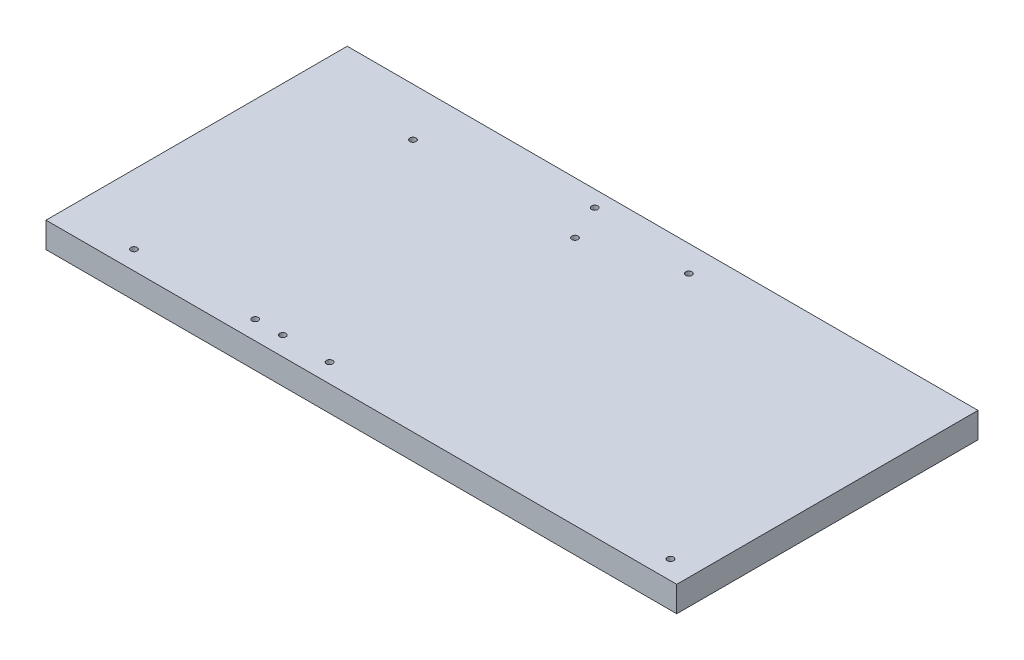
ISO-10303-21;
HEADER;
FILE_DESCRIPTION(('STEP AP214'),'2;1');
FILE_NAME('part.step','',(''),(''),'','','');
FILE_SCHEMA(('AUTOMOTIVE_DESIGN { 1 0 10303 214 1 1 1 1 }'));
ENDSEC;
DATA;
#1=APPLICATION_CONTEXT('core data for automotive mechanical design processes');
#2=APPLICATION_PROTOCOL_DEFINITION('international standard','automotive_design',2000,#1);
#3=PRODUCT_CONTEXT('',#1,'mechanical');
#4=PRODUCT('Part','Part','',(#3));
#5=PRODUCT_RELATED_PRODUCT_CATEGORY('part','',(#4));
#6=PRODUCT_DEFINITION_FORMATION('','',#4);
#7=PRODUCT_DEFINITION_CONTEXT('part definition',#1,'design');
#8=PRODUCT_DEFINITION('design','',#6,#7);
#9=PRODUCT_DEFINITION_SHAPE('','',#8);
#10=(LENGTH_UNIT() NAMED_UNIT(*) SI_UNIT(.MILLI.,.METRE.));
#11=(NAMED_UNIT(*) PLANE_ANGLE_UNIT() SI_UNIT($,.RADIAN.));
#12=(NAMED_UNIT(*) SI_UNIT($,.STERADIAN.) SOLID_ANGLE_UNIT());
#13=UNCERTAINTY_MEASURE_WITH_UNIT(LENGTH_MEASURE(1.E-05),#10,'distance_accuracy_value','');
#14=(GEOMETRIC_REPRESENTATION_CONTEXT(3) GLOBAL_UNCERTAINTY_ASSIGNED_CONTEXT((#13)) GLOBAL_UNIT_ASSIGNED_CONTEXT((#10,
#11,#12)) REPRESENTATION_CONTEXT('',''));
#15=CARTESIAN_POINT('',(0.,0.,0.));
#16=DIRECTION('',(0.,0.,1.));
#17=DIRECTION('',(1.,0.,0.));
#18=AXIS2_PLACEMENT_3D('',#15,#16,#17);
#19=CARTESIAN_POINT('',(-254.781538461539,25.8318,-148.492307692308));
#20=DIRECTION('',(1.,0.,0.));
#21=DIRECTION('',(0.,0.,-1.));
#22=AXIS2_PLACEMENT_3D('',#19,#20,#21);
#23=PLANE('',#22);
#24=DIRECTION('',(0.,0.,1.));
#25=VECTOR('',#24,1.);
#26=CARTESIAN_POINT('',(-254.781538461539,0.,-148.492307692308));
#27=LINE('',#26,#25);
#28=CARTESIAN_POINT('',(-254.781538461539,0.,-148.492307692308));
#29=VERTEX_POINT('',#28);
#30=CARTESIAN_POINT('',(-254.781538461539,0.,156.307692307692));
#31=VERTEX_POINT('',#30);
#32=EDGE_CURVE('E101',#29,#31,#27,.T.);
#33=ORIENTED_EDGE('',*,*,#32,.T.);
#34=DIRECTION('',(0.,-1.,0.));
#35=VECTOR('',#34,1.);
#36=CARTESIAN_POINT('',(-254.781538461539,25.8318,156.307692307692));
#37=LINE('',#36,#35);
#38=CARTESIAN_POINT('',(-254.781538461539,25.8318,156.307692307692));
#39=VERTEX_POINT('',#38);
#40=EDGE_CURVE('E11',#39,#31,#37,.T.);
#41=ORIENTED_EDGE('',*,*,#40,.F.);
#42=DIRECTION('',(0.,0.,1.));
#43=VECTOR('',#42,1.);
#44=CARTESIAN_POINT('',(-254.781538461539,25.8318,-148.492307692308));
#45=LINE('',#44,#43);
#46=CARTESIAN_POINT('',(-254.781538461539,25.8318,-148.492307692308));
#47=VERTEX_POINT('',#46);
#48=EDGE_CURVE('E89',#47,#39,#45,.T.);
#49=ORIENTED_EDGE('',*,*,#48,.F.);
#50=DIRECTION('',(0.,-1.,0.));
#51=VECTOR('',#50,1.);
#52=CARTESIAN_POINT('',(-254.781538461539,25.8318,-148.492307692308));
#53=LINE('',#52,#51);
#54=EDGE_CURVE('E97',#47,#29,#53,.T.);
#55=ORIENTED_EDGE('',*,*,#54,.T.);
#56=EDGE_LOOP('',(#33,#41,#49,#55));
#57=FACE_BOUND('',#56,.T.);
#58=ADVANCED_FACE('F38',(#57),#23,.F.);
#59=CARTESIAN_POINT('',(-254.781538461539,25.8318,156.307692307692));
#60=DIRECTION('',(0.,0.,-1.));
#61=DIRECTION('',(-1.,0.,0.));
#62=AXIS2_PLACEMENT_3D('',#59,#60,#61);
#63=PLANE('',#62);
#64=DIRECTION('',(1.,0.,0.));
#65=VECTOR('',#64,1.);
#66=CARTESIAN_POINT('',(-254.781538461539,0.,156.307692307692));
#67=LINE('',#66,#65);
#68=CARTESIAN_POINT('',(383.393461538461,0.,156.307692307692));
#69=VERTEX_POINT('',#68);
#70=EDGE_CURVE('E93',#31,#69,#67,.T.);
#71=ORIENTED_EDGE('',*,*,#70,.T.);
#72=DIRECTION('',(0.,-1.,0.));
#73=VECTOR('',#72,1.);
#74=CARTESIAN_POINT('',(383.393461538461,25.8318,156.307692307692));
#75=LINE('',#74,#73);
#76=CARTESIAN_POINT('',(383.393461538461,25.8318,156.307692307692));
#77=VERTEX_POINT('',#76);
#78=EDGE_CURVE('E46',#77,#69,#75,.T.);
#79=ORIENTED_EDGE('',*,*,#78,.F.);
#80=DIRECTION('',(1.,0.,0.));
#81=VECTOR('',#80,1.);
#82=CARTESIAN_POINT('',(-254.781538461539,25.8318,156.307692307692));
#83=LINE('',#82,#81);
#84=EDGE_CURVE('E84',#39,#77,#83,.T.);
#85=ORIENTED_EDGE('',*,*,#84,.F.);
#86=ORIENTED_EDGE('',*,*,#40,.T.);
#87=EDGE_LOOP('',(#71,#79,#85,#86));
#88=FACE_BOUND('',#87,.T.);
#89=ADVANCED_FACE('F92',(#88),#63,.F.);
#90=CARTESIAN_POINT('',(383.393461538461,25.8318,-148.492307692308));
#91=DIRECTION('',(-1.,0.,0.));
#92=DIRECTION('',(0.,0.,1.));
#93=AXIS2_PLACEMENT_3D('',#90,#91,#92);
#94=PLANE('',#93);
#95=DIRECTION('',(0.,0.,-1.));
#96=VECTOR('',#95,1.);
#97=CARTESIAN_POINT('',(383.393461538461,0.,-148.492307692308));
#98=LINE('',#97,#96);
#99=CARTESIAN_POINT('',(383.393461538461,0.,-148.492307692308));
#100=VERTEX_POINT('',#99);
#101=EDGE_CURVE('E71',#69,#100,#98,.T.);
#102=ORIENTED_EDGE('',*,*,#101,.T.);
#103=DIRECTION('',(0.,-1.,0.));
#104=VECTOR('',#103,1.);
#105=CARTESIAN_POINT('',(383.393461538461,25.8318,-148.492307692308));
#106=LINE('',#105,#104);
#107=CARTESIAN_POINT('',(383.393461538461,25.8318,-148.492307692308));
#108=VERTEX_POINT('',#107);
#109=EDGE_CURVE('E94',#108,#100,#106,.T.);
#110=ORIENTED_EDGE('',*,*,#109,.F.);
#111=DIRECTION('',(0.,0.,-1.));
#112=VECTOR('',#111,1.);
#113=CARTESIAN_POINT('',(383.393461538461,25.8318,-148.492307692308));
#114=LINE('',#113,#112);
#115=EDGE_CURVE('E87',#77,#108,#114,.T.);
#116=ORIENTED_EDGE('',*,*,#115,.F.);
#117=ORIENTED_EDGE('',*,*,#78,.T.);
#118=EDGE_LOOP('',(#102,#110,#116,#117));
#119=FACE_BOUND('',#118,.T.);
#120=ADVANCED_FACE('F95',(#119),#94,.F.);
#121=CARTESIAN_POINT('',(-254.781538461539,25.8318,-148.492307692308));
#122=DIRECTION('',(0.,0.,1.));
#123=DIRECTION('',(1.,0.,0.));
#124=AXIS2_PLACEMENT_3D('',#121,#122,#123);
#125=PLANE('',#124);
#126=DIRECTION('',(-1.,0.,0.));
#127=VECTOR('',#126,1.);
#128=CARTESIAN_POINT('',(-254.781538461539,0.,-148.492307692308));
#129=LINE('',#128,#127);
#130=EDGE_CURVE('E77',#100,#29,#129,.T.);
#131=ORIENTED_EDGE('',*,*,#130,.T.);
#132=ORIENTED_EDGE('',*,*,#54,.F.);
#133=DIRECTION('',(-1.,0.,0.));
#134=VECTOR('',#133,1.);
#135=CARTESIAN_POINT('',(-254.781538461539,25.8318,-148.492307692308));
#136=LINE('',#135,#134);
#137=EDGE_CURVE('E54',#108,#47,#136,.T.);
#138=ORIENTED_EDGE('',*,*,#137,.F.);
#139=ORIENTED_EDGE('',*,*,#109,.T.);
#140=EDGE_LOOP('',(#131,#132,#138,#139));
#141=FACE_BOUND('',#140,.T.);
#142=ADVANCED_FACE('F109',(#141),#125,.F.);
#143=CARTESIAN_POINT('',(0.,25.8318,0.));
#144=DIRECTION('',(0.,1.,0.));
#145=DIRECTION('',(0.,0.,1.));
#146=AXIS2_PLACEMENT_3D('',#143,#144,#145);
#147=PLANE('',#146);
#148=CARTESIAN_POINT('',(-139.599326464026,25.8318,-99.7621595731455));
#149=DIRECTION('',(0.,1.,0.));
#150=DIRECTION('',(0.,0.,1.));
#151=AXIS2_PLACEMENT_3D('',#148,#149,#150);
#152=CIRCLE('',#151,3.17499999999997);
#153=CARTESIAN_POINT('',(-139.599326464026,25.8318,-96.5871595731456));
#154=VERTEX_POINT('',#153);
#155=EDGE_CURVE('E163',#154,#154,#152,.T.);
#156=ORIENTED_EDGE('',*,*,#155,.F.);
#157=EDGE_LOOP('',(#156));
#158=FACE_BOUND('',#157,.T.);
#159=CARTESIAN_POINT('',(-184.761358461539,25.8318,137.257692307692));
#160=DIRECTION('',(0.,1.,0.));
#161=DIRECTION('',(0.,0.,1.));
#162=AXIS2_PLACEMENT_3D('',#159,#160,#161);
#163=CIRCLE('',#162,3.17499999999997);
#164=CARTESIAN_POINT('',(-184.761358461539,25.8318,140.432692307692));
#165=VERTEX_POINT('',#164);
#166=EDGE_CURVE('E157',#165,#165,#163,.T.);
#167=ORIENTED_EDGE('',*,*,#166,.F.);
#168=EDGE_LOOP('',(#167));
#169=FACE_BOUND('',#168,.T.);
#170=CARTESIAN_POINT('',(28.2792136055013,25.8318,-95.8475990146713));
#171=DIRECTION('',(0.,1.,0.));
#172=DIRECTION('',(0.,0.,1.));
#173=AXIS2_PLACEMENT_3D('',#170,#171,#172);
#174=CIRCLE('',#173,3.17499999999999);
#175=CARTESIAN_POINT('',(28.2792136055013,25.8318,-92.6725990146713));
#176=VERTEX_POINT('',#175);
#177=EDGE_CURVE('E151',#176,#176,#174,.T.);
#178=ORIENTED_EDGE('',*,*,#177,.F.);
#179=EDGE_LOOP('',(#178));
#180=FACE_BOUND('',#179,.T.);
#181=CARTESIAN_POINT('',(-34.2536584615385,25.8318,137.257692307692));
#182=DIRECTION('',(0.,1.,0.));
#183=DIRECTION('',(0.,0.,1.));
#184=AXIS2_PLACEMENT_3D('',#181,#182,#183);
#185=CIRCLE('',#184,3.175);
#186=CARTESIAN_POINT('',(-34.2536584615385,25.8318,140.432692307692));
#187=VERTEX_POINT('',#186);
#188=EDGE_CURVE('E145',#187,#187,#185,.T.);
#189=ORIENTED_EDGE('',*,*,#188,.F.);
#190=EDGE_LOOP('',(#189));
#191=FACE_BOUND('',#190,.T.);
#192=CARTESIAN_POINT('',(117.275186709769,25.8318,-122.058176561719));
#193=DIRECTION('',(0.,1.,0.));
#194=DIRECTION('',(0.,0.,1.));
#195=AXIS2_PLACEMENT_3D('',#192,#193,#194);
#196=CIRCLE('',#195,3.175);
#197=CARTESIAN_POINT('',(117.275186709769,25.8318,-118.883176561719));
#198=VERTEX_POINT('',#197);
#199=EDGE_CURVE('E139',#198,#198,#196,.T.);
#200=ORIENTED_EDGE('',*,*,#199,.F.);
#201=EDGE_LOOP('',(#200));
#202=FACE_BOUND('',#201,.T.);
#203=CARTESIAN_POINT('',(13.1275015384614,25.8318,137.257692307692));
#204=DIRECTION('',(0.,1.,0.));
#205=DIRECTION('',(0.,0.,1.));
#206=AXIS2_PLACEMENT_3D('',#203,#204,#205);
#207=CIRCLE('',#206,3.175);
#208=CARTESIAN_POINT('',(13.1275015384614,25.8318,140.432692307692));
#209=VERTEX_POINT('',#208);
#210=EDGE_CURVE('E133',#209,#209,#207,.T.);
#211=ORIENTED_EDGE('',*,*,#210,.F.);
#212=EDGE_LOOP('',(#211));
#213=FACE_BOUND('',#212,.T.);
#214=CARTESIAN_POINT('',(11.8995090717048,25.8318,-132.169098740326));
#215=DIRECTION('',(0.,1.,0.));
#216=DIRECTION('',(0.,0.,1.));
#217=AXIS2_PLACEMENT_3D('',#214,#215,#216);
#218=CIRCLE('',#217,3.175);
#219=CARTESIAN_POINT('',(11.8995090717048,25.8318,-128.994098740326));
#220=VERTEX_POINT('',#219);
#221=EDGE_CURVE('E127',#220,#220,#218,.T.);
#222=ORIENTED_EDGE('',*,*,#221,.F.);
#223=EDGE_LOOP('',(#222));
#224=FACE_BOUND('',#223,.T.);
#225=CARTESIAN_POINT('',(-62.1733384615385,25.8318,137.257692307692));
#226=DIRECTION('',(0.,1.,0.));
#227=DIRECTION('',(0.,0.,1.));
#228=AXIS2_PLACEMENT_3D('',#225,#226,#227);
#229=CIRCLE('',#228,3.175);
#230=CARTESIAN_POINT('',(-62.1733384615385,25.8318,140.432692307692));
#231=VERTEX_POINT('',#230);
#232=EDGE_CURVE('E121',#231,#231,#229,.T.);
#233=ORIENTED_EDGE('',*,*,#232,.F.);
#234=EDGE_LOOP('',(#233));
#235=FACE_BOUND('',#234,.T.);
#236=CARTESIAN_POINT('',(357.993461538461,25.8318,137.257692307692));
#237=DIRECTION('',(0.,1.,0.));
#238=DIRECTION('',(0.,0.,1.));
#239=AXIS2_PLACEMENT_3D('',#236,#237,#238);
#240=CIRCLE('',#239,3.17499999999997);
#241=CARTESIAN_POINT('',(357.993461538461,25.8318,140.432692307692));
#242=VERTEX_POINT('',#241);
#243=EDGE_CURVE('E115',#242,#242,#240,.T.);
#244=ORIENTED_EDGE('',*,*,#243,.F.);
#245=EDGE_LOOP('',(#244));
#246=FACE_BOUND('',#245,.T.);
#247=ORIENTED_EDGE('',*,*,#48,.T.);
#248=ORIENTED_EDGE('',*,*,#84,.T.);
#249=ORIENTED_EDGE('',*,*,#115,.T.);
#250=ORIENTED_EDGE('',*,*,#137,.T.);
#251=EDGE_LOOP('',(#247,#248,#249,#250));
#252=FACE_BOUND('',#251,.T.);
#253=ADVANCED_FACE('F85',(#158,#169,#180,#191,#202,#213,#224,#235,#246,#252),#147,.T.);
#254=CARTESIAN_POINT('',(0.,0.,0.));
#255=DIRECTION('',(0.,1.,0.));
#256=DIRECTION('',(0.,0.,1.));
#257=AXIS2_PLACEMENT_3D('',#254,#255,#256);
#258=PLANE('',#257);
#259=CARTESIAN_POINT('',(-139.599326464026,0.,-99.7621595731455));
#260=DIRECTION('',(0.,1.,0.));
#261=DIRECTION('',(0.,0.,1.));
#262=AXIS2_PLACEMENT_3D('',#259,#260,#261);
#263=CIRCLE('',#262,3.17499999999997);
#264=CARTESIAN_POINT('',(-139.599326464026,0.,-96.5871595731456));
#265=VERTEX_POINT('',#264);
#266=EDGE_CURVE('E160',#265,#265,#263,.T.);
#267=ORIENTED_EDGE('',*,*,#266,.T.);
#268=EDGE_LOOP('',(#267));
#269=FACE_BOUND('',#268,.T.);
#270=CARTESIAN_POINT('',(-184.761358461539,0.,137.257692307692));
#271=DIRECTION('',(0.,1.,0.));
#272=DIRECTION('',(0.,0.,1.));
#273=AXIS2_PLACEMENT_3D('',#270,#271,#272);
#274=CIRCLE('',#273,3.17499999999997);
#275=CARTESIAN_POINT('',(-184.761358461539,0.,140.432692307692));
#276=VERTEX_POINT('',#275);
#277=EDGE_CURVE('E154',#276,#276,#274,.T.);
#278=ORIENTED_EDGE('',*,*,#277,.T.);
#279=EDGE_LOOP('',(#278));
#280=FACE_BOUND('',#279,.T.);
#281=CARTESIAN_POINT('',(28.2792136055013,0.,-95.8475990146713));
#282=DIRECTION('',(0.,1.,0.));
#283=DIRECTION('',(0.,0.,1.));
#284=AXIS2_PLACEMENT_3D('',#281,#282,#283);
#285=CIRCLE('',#284,3.17499999999999);
#286=CARTESIAN_POINT('',(28.2792136055013,0.,-92.6725990146713));
#287=VERTEX_POINT('',#286);
#288=EDGE_CURVE('E148',#287,#287,#285,.T.);
#289=ORIENTED_EDGE('',*,*,#288,.T.);
#290=EDGE_LOOP('',(#289));
#291=FACE_BOUND('',#290,.T.);
#292=CARTESIAN_POINT('',(-34.2536584615385,0.,137.257692307692));
#293=DIRECTION('',(0.,1.,0.));
#294=DIRECTION('',(0.,0.,1.));
#295=AXIS2_PLACEMENT_3D('',#292,#293,#294);
#296=CIRCLE('',#295,3.175);
#297=CARTESIAN_POINT('',(-34.2536584615385,0.,140.432692307692));
#298=VERTEX_POINT('',#297);
#299=EDGE_CURVE('E142',#298,#298,#296,.T.);
#300=ORIENTED_EDGE('',*,*,#299,.T.);
#301=EDGE_LOOP('',(#300));
#302=FACE_BOUND('',#301,.T.);
#303=CARTESIAN_POINT('',(117.275186709769,0.,-122.058176561719));
#304=DIRECTION('',(0.,1.,0.));
#305=DIRECTION('',(0.,0.,1.));
#306=AXIS2_PLACEMENT_3D('',#303,#304,#305);
#307=CIRCLE('',#306,3.175);
#308=CARTESIAN_POINT('',(117.275186709769,0.,-118.883176561719));
#309=VERTEX_POINT('',#308);
#310=EDGE_CURVE('E136',#309,#309,#307,.T.);
#311=ORIENTED_EDGE('',*,*,#310,.T.);
#312=EDGE_LOOP('',(#311));
#313=FACE_BOUND('',#312,.T.);
#314=CARTESIAN_POINT('',(13.1275015384614,0.,137.257692307692));
#315=DIRECTION('',(0.,1.,0.));
#316=DIRECTION('',(0.,0.,1.));
#317=AXIS2_PLACEMENT_3D('',#314,#315,#316);
#318=CIRCLE('',#317,3.175);
#319=CARTESIAN_POINT('',(13.1275015384614,0.,140.432692307692));
#320=VERTEX_POINT('',#319);
#321=EDGE_CURVE('E130',#320,#320,#318,.T.);
#322=ORIENTED_EDGE('',*,*,#321,.T.);
#323=EDGE_LOOP('',(#322));
#324=FACE_BOUND('',#323,.T.);
#325=CARTESIAN_POINT('',(11.8995090717048,0.,-132.169098740326));
#326=DIRECTION('',(0.,1.,0.));
#327=DIRECTION('',(0.,0.,1.));
#328=AXIS2_PLACEMENT_3D('',#325,#326,#327);
#329=CIRCLE('',#328,3.175);
#330=CARTESIAN_POINT('',(11.8995090717048,0.,-128.994098740326));
#331=VERTEX_POINT('',#330);
#332=EDGE_CURVE('E124',#331,#331,#329,.T.);
#333=ORIENTED_EDGE('',*,*,#332,.T.);
#334=EDGE_LOOP('',(#333));
#335=FACE_BOUND('',#334,.T.);
#336=CARTESIAN_POINT('',(-62.1733384615385,0.,137.257692307692));
#337=DIRECTION('',(0.,1.,0.));
#338=DIRECTION('',(0.,0.,1.));
#339=AXIS2_PLACEMENT_3D('',#336,#337,#338);
#340=CIRCLE('',#339,3.175);
#341=CARTESIAN_POINT('',(-62.1733384615385,0.,140.432692307692));
#342=VERTEX_POINT('',#341);
#343=EDGE_CURVE('E118',#342,#342,#340,.T.);
#344=ORIENTED_EDGE('',*,*,#343,.T.);
#345=EDGE_LOOP('',(#344));
#346=FACE_BOUND('',#345,.T.);
#347=CARTESIAN_POINT('',(357.993461538461,0.,137.257692307692));
#348=DIRECTION('',(0.,1.,0.));
#349=DIRECTION('',(0.,0.,1.));
#350=AXIS2_PLACEMENT_3D('',#347,#348,#349);
#351=CIRCLE('',#350,3.17499999999997);
#352=CARTESIAN_POINT('',(357.993461538461,0.,140.432692307692));
#353=VERTEX_POINT('',#352);
#354=EDGE_CURVE('E104',#353,#353,#351,.T.);
#355=ORIENTED_EDGE('',*,*,#354,.T.);
#356=EDGE_LOOP('',(#355));
#357=FACE_BOUND('',#356,.T.);
#358=ORIENTED_EDGE('',*,*,#32,.F.);
#359=ORIENTED_EDGE('',*,*,#130,.F.);
#360=ORIENTED_EDGE('',*,*,#101,.F.);
#361=ORIENTED_EDGE('',*,*,#70,.F.);
#362=EDGE_LOOP('',(#358,#359,#360,#361));
#363=FACE_BOUND('',#362,.T.);
#364=ADVANCED_FACE('F112',(#269,#280,#291,#302,#313,#324,#335,#346,#357,#363),#258,.F.);
#365=CARTESIAN_POINT('',(357.993461538461,0.,137.257692307692));
#366=DIRECTION('',(0.,1.,0.));
#367=DIRECTION('',(0.,0.,1.));
#368=AXIS2_PLACEMENT_3D('',#365,#366,#367);
#369=CYLINDRICAL_SURFACE('',#368,3.17499999999997);
#370=ORIENTED_EDGE('',*,*,#354,.F.);
#371=EDGE_LOOP('',(#370));
#372=FACE_BOUND('',#371,.T.);
#373=ORIENTED_EDGE('',*,*,#243,.T.);
#374=EDGE_LOOP('',(#373));
#375=FACE_BOUND('',#374,.T.);
#376=ADVANCED_FACE('F197',(#372,#375),#369,.F.);
#377=CARTESIAN_POINT('',(-62.1733384615385,0.,137.257692307692));
#378=DIRECTION('',(0.,1.,0.));
#379=DIRECTION('',(0.,0.,1.));
#380=AXIS2_PLACEMENT_3D('',#377,#378,#379);
#381=CYLINDRICAL_SURFACE('',#380,3.175);
#382=ORIENTED_EDGE('',*,*,#343,.F.);
#383=EDGE_LOOP('',(#382));
#384=FACE_BOUND('',#383,.T.);
#385=ORIENTED_EDGE('',*,*,#232,.T.);
#386=EDGE_LOOP('',(#385));
#387=FACE_BOUND('',#386,.T.);
#388=ADVANCED_FACE('F199',(#384,#387),#381,.F.);
#389=CARTESIAN_POINT('',(11.8995090717048,0.,-132.169098740326));
#390=DIRECTION('',(0.,1.,0.));
#391=DIRECTION('',(0.,0.,1.));
#392=AXIS2_PLACEMENT_3D('',#389,#390,#391);
#393=CYLINDRICAL_SURFACE('',#392,3.175);
#394=ORIENTED_EDGE('',*,*,#332,.F.);
#395=EDGE_LOOP('',(#394));
#396=FACE_BOUND('',#395,.T.);
#397=ORIENTED_EDGE('',*,*,#221,.T.);
#398=EDGE_LOOP('',(#397));
#399=FACE_BOUND('',#398,.T.);
#400=ADVANCED_FACE('F206',(#396,#399),#393,.F.);
#401=CARTESIAN_POINT('',(13.1275015384614,0.,137.257692307692));
#402=DIRECTION('',(0.,1.,0.));
#403=DIRECTION('',(0.,0.,1.));
#404=AXIS2_PLACEMENT_3D('',#401,#402,#403);
#405=CYLINDRICAL_SURFACE('',#404,3.175);
#406=ORIENTED_EDGE('',*,*,#321,.F.);
#407=EDGE_LOOP('',(#406));
#408=FACE_BOUND('',#407,.T.);
#409=ORIENTED_EDGE('',*,*,#210,.T.);
#410=EDGE_LOOP('',(#409));
#411=FACE_BOUND('',#410,.T.);
#412=ADVANCED_FACE('F284',(#408,#411),#405,.F.);
#413=CARTESIAN_POINT('',(117.275186709769,0.,-122.058176561719));
#414=DIRECTION('',(0.,1.,0.));
#415=DIRECTION('',(0.,0.,1.));
#416=AXIS2_PLACEMENT_3D('',#413,#414,#415);
#417=CYLINDRICAL_SURFACE('',#416,3.175);
#418=ORIENTED_EDGE('',*,*,#310,.F.);
#419=EDGE_LOOP('',(#418));
#420=FACE_BOUND('',#419,.T.);
#421=ORIENTED_EDGE('',*,*,#199,.T.);
#422=EDGE_LOOP('',(#421));
#423=FACE_BOUND('',#422,.T.);
#424=ADVANCED_FACE('F276',(#420,#423),#417,.F.);
#425=CARTESIAN_POINT('',(-34.2536584615385,0.,137.257692307692));
#426=DIRECTION('',(0.,1.,0.));
#427=DIRECTION('',(0.,0.,1.));
#428=AXIS2_PLACEMENT_3D('',#425,#426,#427);
#429=CYLINDRICAL_SURFACE('',#428,3.175);
#430=ORIENTED_EDGE('',*,*,#299,.F.);
#431=EDGE_LOOP('',(#430));
#432=FACE_BOUND('',#431,.T.);
#433=ORIENTED_EDGE('',*,*,#188,.T.);
#434=EDGE_LOOP('',(#433));
#435=FACE_BOUND('',#434,.T.);
#436=ADVANCED_FACE('F269',(#432,#435),#429,.F.);
#437=CARTESIAN_POINT('',(28.2792136055013,0.,-95.8475990146713));
#438=DIRECTION('',(0.,1.,0.));
#439=DIRECTION('',(0.,0.,1.));
#440=AXIS2_PLACEMENT_3D('',#437,#438,#439);
#441=CYLINDRICAL_SURFACE('',#440,3.17499999999999);
#442=ORIENTED_EDGE('',*,*,#288,.F.);
#443=EDGE_LOOP('',(#442));
#444=FACE_BOUND('',#443,.T.);
#445=ORIENTED_EDGE('',*,*,#177,.T.);
#446=EDGE_LOOP('',(#445));
#447=FACE_BOUND('',#446,.T.);
#448=ADVANCED_FACE('F250',(#444,#447),#441,.F.);
#449=CARTESIAN_POINT('',(-184.761358461539,0.,137.257692307692));
#450=DIRECTION('',(0.,1.,0.));
#451=DIRECTION('',(0.,0.,1.));
#452=AXIS2_PLACEMENT_3D('',#449,#450,#451);
#453=CYLINDRICAL_SURFACE('',#452,3.17499999999997);
#454=ORIENTED_EDGE('',*,*,#277,.F.);
#455=EDGE_LOOP('',(#454));
#456=FACE_BOUND('',#455,.T.);
#457=ORIENTED_EDGE('',*,*,#166,.T.);
#458=EDGE_LOOP('',(#457));
#459=FACE_BOUND('',#458,.T.);
#460=ADVANCED_FACE('F174',(#456,#459),#453,.F.);
#461=CARTESIAN_POINT('',(-139.599326464026,0.,-99.7621595731455));
#462=DIRECTION('',(0.,1.,0.));
#463=DIRECTION('',(0.,0.,1.));
#464=AXIS2_PLACEMENT_3D('',#461,#462,#463);
#465=CYLINDRICAL_SURFACE('',#464,3.17499999999997);
#466=ORIENTED_EDGE('',*,*,#266,.F.);
#467=EDGE_LOOP('',(#466));
#468=FACE_BOUND('',#467,.T.);
#469=ORIENTED_EDGE('',*,*,#155,.T.);
#470=EDGE_LOOP('',(#469));
#471=FACE_BOUND('',#470,.T.);
#472=ADVANCED_FACE('F171',(#468,#471),#465,.F.);
#473=CLOSED_SHELL('',(#58,#89,#120,#142,#253,#364,#376,#388,#400,#412,#424,#436,#448,#460,#472));
#474=MANIFOLD_SOLID_BREP('B2',#473);
#475=ADVANCED_BREP_SHAPE_REPRESENTATION('',(#18,#474),#14);
#476=SHAPE_DEFINITION_REPRESENTATION(#9,#475);
ENDSEC;
END-ISO-10303-21;
